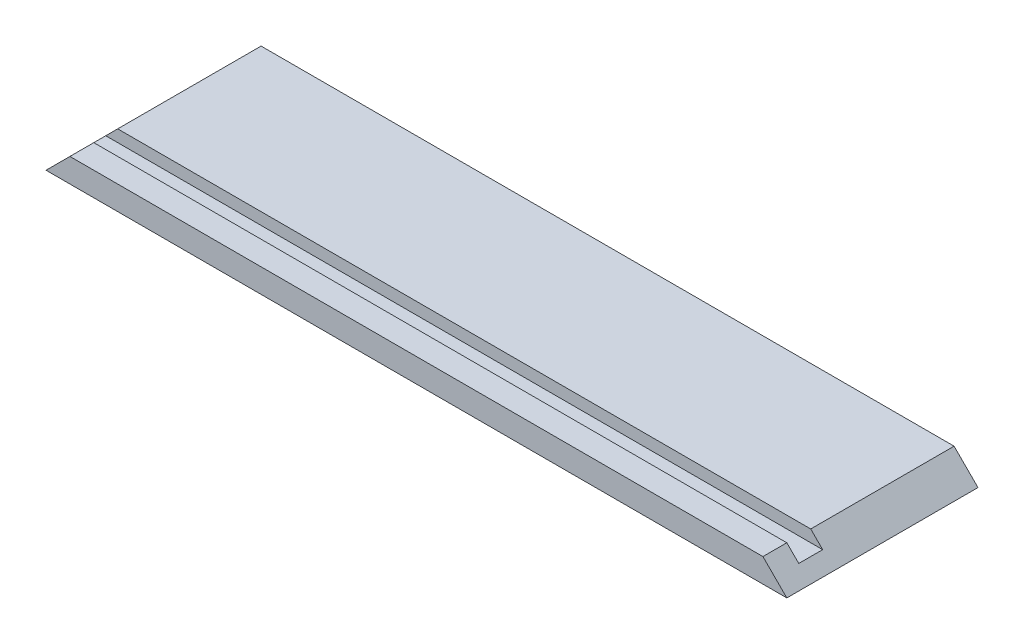
ISO-10303-21;
HEADER;
FILE_DESCRIPTION(('STEP AP214'),'2;1');
FILE_NAME('part.step','',(''),(''),'','','');
FILE_SCHEMA(('AUTOMOTIVE_DESIGN { 1 0 10303 214 1 1 1 1 }'));
ENDSEC;
DATA;
#1=APPLICATION_CONTEXT('core data for automotive mechanical design processes');
#2=APPLICATION_PROTOCOL_DEFINITION('international standard','automotive_design',2000,#1);
#3=PRODUCT_CONTEXT('',#1,'mechanical');
#4=PRODUCT('Part','Part','',(#3));
#5=PRODUCT_RELATED_PRODUCT_CATEGORY('part','',(#4));
#6=PRODUCT_DEFINITION_FORMATION('','',#4);
#7=PRODUCT_DEFINITION_CONTEXT('part definition',#1,'design');
#8=PRODUCT_DEFINITION('design','',#6,#7);
#9=PRODUCT_DEFINITION_SHAPE('','',#8);
#10=(LENGTH_UNIT() NAMED_UNIT(*) SI_UNIT(.MILLI.,.METRE.));
#11=(NAMED_UNIT(*) PLANE_ANGLE_UNIT() SI_UNIT($,.RADIAN.));
#12=(NAMED_UNIT(*) SI_UNIT($,.STERADIAN.) SOLID_ANGLE_UNIT());
#13=UNCERTAINTY_MEASURE_WITH_UNIT(LENGTH_MEASURE(1.E-05),#10,'distance_accuracy_value','');
#14=(GEOMETRIC_REPRESENTATION_CONTEXT(3) GLOBAL_UNCERTAINTY_ASSIGNED_CONTEXT((#13)) GLOBAL_UNIT_ASSIGNED_CONTEXT((#10,
#11,#12)) REPRESENTATION_CONTEXT('',''));
#15=CARTESIAN_POINT('',(0.,0.,0.));
#16=DIRECTION('',(0.,0.,1.));
#17=DIRECTION('',(1.,0.,0.));
#18=AXIS2_PLACEMENT_3D('',#15,#16,#17);
#19=CARTESIAN_POINT('',(0.,6.35,0.));
#20=DIRECTION('',(0.,1.,0.));
#21=DIRECTION('',(0.,0.,1.));
#22=AXIS2_PLACEMENT_3D('',#19,#20,#21);
#23=PLANE('',#22);
#24=DIRECTION('',(0.,0.,-1.));
#25=VECTOR('',#24,1.);
#26=CARTESIAN_POINT('',(92.0749999999999,6.35,343.147925876495));
#27=LINE('',#26,#25);
#28=CARTESIAN_POINT('',(92.0749999999999,6.35,12.7));
#29=VERTEX_POINT('',#28);
#30=CARTESIAN_POINT('',(92.0749999999999,6.34999999999999,-25.4));
#31=VERTEX_POINT('',#30);
#32=EDGE_CURVE('E50',#29,#31,#27,.T.);
#33=ORIENTED_EDGE('',*,*,#32,.T.);
#34=DIRECTION('',(-1.,0.,0.));
#35=VECTOR('',#34,1.);
#36=CARTESIAN_POINT('',(-98.425,6.35,-25.4));
#37=LINE('',#36,#35);
#38=CARTESIAN_POINT('',(-92.075,6.35,-25.4));
#39=VERTEX_POINT('',#38);
#40=EDGE_CURVE('E43',#31,#39,#37,.T.);
#41=ORIENTED_EDGE('',*,*,#40,.T.);
#42=DIRECTION('',(0.,0.,-1.));
#43=VECTOR('',#42,1.);
#44=CARTESIAN_POINT('',(-92.075,6.35,295.522925876496));
#45=LINE('',#44,#43);
#46=CARTESIAN_POINT('',(-92.075,6.35,12.7));
#47=VERTEX_POINT('',#46);
#48=EDGE_CURVE('E148',#47,#39,#45,.T.);
#49=ORIENTED_EDGE('',*,*,#48,.F.);
#50=DIRECTION('',(-1.,0.,0.));
#51=VECTOR('',#50,1.);
#52=CARTESIAN_POINT('',(-98.425,6.35,12.7));
#53=LINE('',#52,#51);
#54=EDGE_CURVE('E129',#29,#47,#53,.T.);
#55=ORIENTED_EDGE('',*,*,#54,.F.);
#56=EDGE_LOOP('',(#33,#41,#49,#55));
#57=FACE_BOUND('',#56,.T.);
#58=ADVANCED_FACE('F35',(#57),#23,.T.);
#59=CARTESIAN_POINT('',(-98.425,6.35,25.4));
#60=DIRECTION('',(0.,0.,-1.));
#61=DIRECTION('',(-1.,0.,0.));
#62=AXIS2_PLACEMENT_3D('',#59,#60,#61);
#63=PLANE('',#62);
#64=DIRECTION('',(1.,0.,0.));
#65=VECTOR('',#64,1.);
#66=CARTESIAN_POINT('',(-98.425,0.,25.4));
#67=LINE('',#66,#65);
#68=CARTESIAN_POINT('',(-98.425,0.,25.4));
#69=VERTEX_POINT('',#68);
#70=CARTESIAN_POINT('',(98.425,0.,25.4));
#71=VERTEX_POINT('',#70);
#72=EDGE_CURVE('E121',#69,#71,#67,.T.);
#73=ORIENTED_EDGE('',*,*,#72,.T.);
#74=DIRECTION('',(-0.707106781186553,0.707106781186542,0.));
#75=VECTOR('',#74,1.);
#76=CARTESIAN_POINT('',(-3.17500000000143,101.6,25.4));
#77=LINE('',#76,#75);
#78=CARTESIAN_POINT('',(92.0749999999999,6.35,25.4));
#79=VERTEX_POINT('',#78);
#80=EDGE_CURVE('E58',#71,#79,#77,.T.);
#81=ORIENTED_EDGE('',*,*,#80,.T.);
#82=DIRECTION('',(1.,0.,0.));
#83=VECTOR('',#82,1.);
#84=CARTESIAN_POINT('',(-98.425,6.35,25.4));
#85=LINE('',#84,#83);
#86=CARTESIAN_POINT('',(-92.075,6.35,25.4));
#87=VERTEX_POINT('',#86);
#88=EDGE_CURVE('E112',#87,#79,#85,.T.);
#89=ORIENTED_EDGE('',*,*,#88,.F.);
#90=DIRECTION('',(0.707106781186546,0.707106781186549,0.));
#91=VECTOR('',#90,1.);
#92=CARTESIAN_POINT('',(-95.25,3.17500000000001,25.4));
#93=LINE('',#92,#91);
#94=EDGE_CURVE('E135',#69,#87,#93,.T.);
#95=ORIENTED_EDGE('',*,*,#94,.F.);
#96=EDGE_LOOP('',(#73,#81,#89,#95));
#97=FACE_BOUND('',#96,.T.);
#98=ADVANCED_FACE('F37',(#97),#63,.F.);
#99=CARTESIAN_POINT('',(-98.425,6.35,-25.4));
#100=DIRECTION('',(0.,0.,1.));
#101=DIRECTION('',(1.,0.,0.));
#102=AXIS2_PLACEMENT_3D('',#99,#100,#101);
#103=PLANE('',#102);
#104=ORIENTED_EDGE('',*,*,#40,.F.);
#105=DIRECTION('',(0.707106781186553,-0.707106781186542,0.));
#106=VECTOR('',#105,1.);
#107=CARTESIAN_POINT('',(-3.17500000000143,101.6,-25.4));
#108=LINE('',#107,#106);
#109=CARTESIAN_POINT('',(98.425,0.,-25.4));
#110=VERTEX_POINT('',#109);
#111=EDGE_CURVE('E114',#31,#110,#108,.T.);
#112=ORIENTED_EDGE('',*,*,#111,.T.);
#113=DIRECTION('',(-1.,0.,0.));
#114=VECTOR('',#113,1.);
#115=CARTESIAN_POINT('',(-98.425,0.,-25.4));
#116=LINE('',#115,#114);
#117=CARTESIAN_POINT('',(-98.425,0.,-25.4));
#118=VERTEX_POINT('',#117);
#119=EDGE_CURVE('E103',#110,#118,#116,.T.);
#120=ORIENTED_EDGE('',*,*,#119,.T.);
#121=DIRECTION('',(-0.707106781186546,-0.707106781186549,0.));
#122=VECTOR('',#121,1.);
#123=CARTESIAN_POINT('',(-95.25,3.17500000000001,-25.4));
#124=LINE('',#123,#122);
#125=EDGE_CURVE('E140',#39,#118,#124,.T.);
#126=ORIENTED_EDGE('',*,*,#125,.F.);
#127=EDGE_LOOP('',(#104,#112,#120,#126));
#128=FACE_BOUND('',#127,.T.);
#129=ADVANCED_FACE('F115',(#128),#103,.F.);
#130=CARTESIAN_POINT('',(92.0749999999999,6.35,19.05));
#131=VERTEX_POINT('',#130);
#132=EDGE_CURVE('E158',#79,#131,#27,.T.);
#133=ORIENTED_EDGE('',*,*,#132,.T.);
#134=DIRECTION('',(1.,0.,0.));
#135=VECTOR('',#134,1.);
#136=CARTESIAN_POINT('',(-98.425,6.35,19.05));
#137=LINE('',#136,#135);
#138=CARTESIAN_POINT('',(-92.075,6.35,19.05));
#139=VERTEX_POINT('',#138);
#140=EDGE_CURVE('E132',#139,#131,#137,.T.);
#141=ORIENTED_EDGE('',*,*,#140,.F.);
#142=EDGE_CURVE('E147',#87,#139,#45,.T.);
#143=ORIENTED_EDGE('',*,*,#142,.F.);
#144=ORIENTED_EDGE('',*,*,#88,.T.);
#145=EDGE_LOOP('',(#133,#141,#143,#144));
#146=FACE_BOUND('',#145,.T.);
#147=ADVANCED_FACE('F161',(#146),#23,.T.);
#148=CARTESIAN_POINT('',(-98.425,3.175,12.7));
#149=DIRECTION('',(0.,0.,-1.));
#150=DIRECTION('',(-1.,0.,0.));
#151=AXIS2_PLACEMENT_3D('',#148,#149,#150);
#152=PLANE('',#151);
#153=DIRECTION('',(-1.,0.,0.));
#154=VECTOR('',#153,1.);
#155=CARTESIAN_POINT('',(-98.425,3.175,12.7));
#156=LINE('',#155,#154);
#157=CARTESIAN_POINT('',(95.25,3.175,12.7));
#158=VERTEX_POINT('',#157);
#159=CARTESIAN_POINT('',(-95.25,3.175,12.7));
#160=VERTEX_POINT('',#159);
#161=EDGE_CURVE('E126',#158,#160,#156,.T.);
#162=ORIENTED_EDGE('',*,*,#161,.F.);
#163=DIRECTION('',(-0.707106781186553,0.707106781186542,0.));
#164=VECTOR('',#163,1.);
#165=CARTESIAN_POINT('',(-1.58750000000142,100.0125,12.7));
#166=LINE('',#165,#164);
#167=EDGE_CURVE('E117',#158,#29,#166,.T.);
#168=ORIENTED_EDGE('',*,*,#167,.T.);
#169=ORIENTED_EDGE('',*,*,#54,.T.);
#170=DIRECTION('',(0.707106781186546,0.707106781186549,0.));
#171=VECTOR('',#170,1.);
#172=CARTESIAN_POINT('',(-96.8375,1.5875,12.7));
#173=LINE('',#172,#171);
#174=EDGE_CURVE('E142',#160,#47,#173,.T.);
#175=ORIENTED_EDGE('',*,*,#174,.F.);
#176=EDGE_LOOP('',(#162,#168,#169,#175));
#177=FACE_BOUND('',#176,.T.);
#178=ADVANCED_FACE('F175',(#177),#152,.F.);
#179=CARTESIAN_POINT('',(-98.425,3.175,19.05));
#180=DIRECTION('',(0.,0.,1.));
#181=DIRECTION('',(1.,0.,0.));
#182=AXIS2_PLACEMENT_3D('',#179,#180,#181);
#183=PLANE('',#182);
#184=ORIENTED_EDGE('',*,*,#140,.T.);
#185=DIRECTION('',(0.707106781186553,-0.707106781186542,0.));
#186=VECTOR('',#185,1.);
#187=CARTESIAN_POINT('',(-1.58750000000142,100.0125,19.05));
#188=LINE('',#187,#186);
#189=CARTESIAN_POINT('',(95.25,3.175,19.05));
#190=VERTEX_POINT('',#189);
#191=EDGE_CURVE('E153',#131,#190,#188,.T.);
#192=ORIENTED_EDGE('',*,*,#191,.T.);
#193=DIRECTION('',(1.,0.,0.));
#194=VECTOR('',#193,1.);
#195=CARTESIAN_POINT('',(-98.425,3.175,19.05));
#196=LINE('',#195,#194);
#197=CARTESIAN_POINT('',(-95.25,3.175,19.05));
#198=VERTEX_POINT('',#197);
#199=EDGE_CURVE('E131',#198,#190,#196,.T.);
#200=ORIENTED_EDGE('',*,*,#199,.F.);
#201=DIRECTION('',(-0.707106781186546,-0.707106781186549,0.));
#202=VECTOR('',#201,1.);
#203=CARTESIAN_POINT('',(-96.8375,1.5875,19.05));
#204=LINE('',#203,#202);
#205=EDGE_CURVE('E145',#139,#198,#204,.T.);
#206=ORIENTED_EDGE('',*,*,#205,.F.);
#207=EDGE_LOOP('',(#184,#192,#200,#206));
#208=FACE_BOUND('',#207,.T.);
#209=ADVANCED_FACE('F166',(#208),#183,.F.);
#210=CARTESIAN_POINT('',(0.,3.175,0.));
#211=DIRECTION('',(0.,1.,0.));
#212=DIRECTION('',(0.,0.,1.));
#213=AXIS2_PLACEMENT_3D('',#210,#211,#212);
#214=PLANE('',#213);
#215=DIRECTION('',(0.,0.,1.));
#216=VECTOR('',#215,1.);
#217=CARTESIAN_POINT('',(95.25,3.175,0.));
#218=LINE('',#217,#216);
#219=EDGE_CURVE('E155',#158,#190,#218,.T.);
#220=ORIENTED_EDGE('',*,*,#219,.F.);
#221=ORIENTED_EDGE('',*,*,#161,.T.);
#222=DIRECTION('',(0.,0.,1.));
#223=VECTOR('',#222,1.);
#224=CARTESIAN_POINT('',(-95.25,3.175,0.));
#225=LINE('',#224,#223);
#226=EDGE_CURVE('E11',#160,#198,#225,.T.);
#227=ORIENTED_EDGE('',*,*,#226,.T.);
#228=ORIENTED_EDGE('',*,*,#199,.T.);
#229=EDGE_LOOP('',(#220,#221,#227,#228));
#230=FACE_BOUND('',#229,.T.);
#231=ADVANCED_FACE('F171',(#230),#214,.T.);
#232=CARTESIAN_POINT('',(0.,0.,0.));
#233=DIRECTION('',(0.,1.,0.));
#234=DIRECTION('',(0.,0.,1.));
#235=AXIS2_PLACEMENT_3D('',#232,#233,#234);
#236=PLANE('',#235);
#237=DIRECTION('',(0.,0.,1.));
#238=VECTOR('',#237,1.);
#239=CARTESIAN_POINT('',(-98.425,0.,-25.4));
#240=LINE('',#239,#238);
#241=EDGE_CURVE('E109',#118,#69,#240,.T.);
#242=ORIENTED_EDGE('',*,*,#241,.F.);
#243=ORIENTED_EDGE('',*,*,#119,.F.);
#244=DIRECTION('',(0.,0.,-1.));
#245=VECTOR('',#244,1.);
#246=CARTESIAN_POINT('',(98.425,0.,-25.4));
#247=LINE('',#246,#245);
#248=EDGE_CURVE('E108',#71,#110,#247,.T.);
#249=ORIENTED_EDGE('',*,*,#248,.F.);
#250=ORIENTED_EDGE('',*,*,#72,.F.);
#251=EDGE_LOOP('',(#242,#243,#249,#250));
#252=FACE_BOUND('',#251,.T.);
#253=ADVANCED_FACE('F105',(#252),#236,.F.);
#254=CARTESIAN_POINT('',(-98.425,0.,295.522925876496));
#255=DIRECTION('',(-0.707106781186549,0.707106781186546,0.));
#256=DIRECTION('',(-0.707106781186546,-0.707106781186549,0.));
#257=AXIS2_PLACEMENT_3D('',#254,#255,#256);
#258=PLANE('',#257);
#259=ORIENTED_EDGE('',*,*,#241,.T.);
#260=ORIENTED_EDGE('',*,*,#94,.T.);
#261=ORIENTED_EDGE('',*,*,#142,.T.);
#262=ORIENTED_EDGE('',*,*,#205,.T.);
#263=ORIENTED_EDGE('',*,*,#226,.F.);
#264=ORIENTED_EDGE('',*,*,#174,.T.);
#265=ORIENTED_EDGE('',*,*,#48,.T.);
#266=ORIENTED_EDGE('',*,*,#125,.T.);
#267=EDGE_LOOP('',(#259,#260,#261,#262,#263,#264,#265,#266));
#268=FACE_BOUND('',#267,.T.);
#269=ADVANCED_FACE('F178',(#268),#258,.T.);
#270=CARTESIAN_POINT('',(98.425,0.,343.147925876495));
#271=DIRECTION('',(-0.707106781186542,-0.707106781186553,0.));
#272=DIRECTION('',(0.707106781186553,-0.707106781186542,0.));
#273=AXIS2_PLACEMENT_3D('',#270,#271,#272);
#274=PLANE('',#273);
#275=ORIENTED_EDGE('',*,*,#80,.F.);
#276=ORIENTED_EDGE('',*,*,#248,.T.);
#277=ORIENTED_EDGE('',*,*,#111,.F.);
#278=ORIENTED_EDGE('',*,*,#32,.F.);
#279=ORIENTED_EDGE('',*,*,#167,.F.);
#280=ORIENTED_EDGE('',*,*,#219,.T.);
#281=ORIENTED_EDGE('',*,*,#191,.F.);
#282=ORIENTED_EDGE('',*,*,#132,.F.);
#283=EDGE_LOOP('',(#275,#276,#277,#278,#279,#280,#281,#282));
#284=FACE_BOUND('',#283,.T.);
#285=ADVANCED_FACE('F119',(#284),#274,.F.);
#286=CLOSED_SHELL('',(#58,#98,#129,#147,#178,#209,#231,#253,#269,#285));
#287=MANIFOLD_SOLID_BREP('B2',#286);
#288=ADVANCED_BREP_SHAPE_REPRESENTATION('',(#18,#287),#14);
#289=SHAPE_DEFINITION_REPRESENTATION(#9,#288);
ENDSEC;
END-ISO-10303-21;
